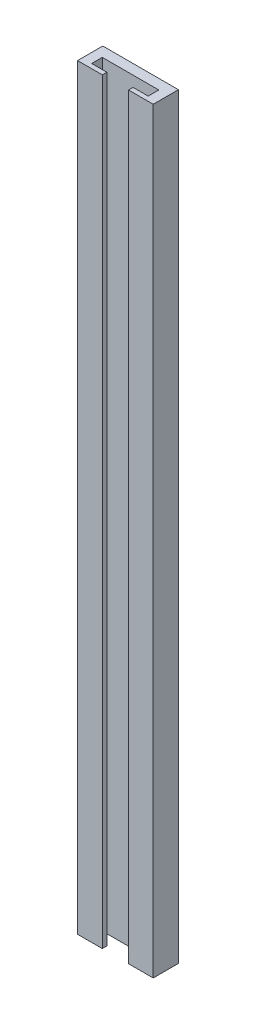
ISO-10303-21;
HEADER;
FILE_DESCRIPTION(('STEP AP214'),'2;1');
FILE_NAME('part.step','',(''),(''),'','','');
FILE_SCHEMA(('AUTOMOTIVE_DESIGN { 1 0 10303 214 1 1 1 1 }'));
ENDSEC;
DATA;
#1=APPLICATION_CONTEXT('core data for automotive mechanical design processes');
#2=APPLICATION_PROTOCOL_DEFINITION('international standard','automotive_design',2000,#1);
#3=PRODUCT_CONTEXT('',#1,'mechanical');
#4=PRODUCT('Part','Part','',(#3));
#5=PRODUCT_RELATED_PRODUCT_CATEGORY('part','',(#4));
#6=PRODUCT_DEFINITION_FORMATION('','',#4);
#7=PRODUCT_DEFINITION_CONTEXT('part definition',#1,'design');
#8=PRODUCT_DEFINITION('design','',#6,#7);
#9=PRODUCT_DEFINITION_SHAPE('','',#8);
#10=(LENGTH_UNIT() NAMED_UNIT(*) SI_UNIT(.MILLI.,.METRE.));
#11=(NAMED_UNIT(*) PLANE_ANGLE_UNIT() SI_UNIT($,.RADIAN.));
#12=(NAMED_UNIT(*) SI_UNIT($,.STERADIAN.) SOLID_ANGLE_UNIT());
#13=UNCERTAINTY_MEASURE_WITH_UNIT(LENGTH_MEASURE(1.E-05),#10,'distance_accuracy_value','');
#14=(GEOMETRIC_REPRESENTATION_CONTEXT(3) GLOBAL_UNCERTAINTY_ASSIGNED_CONTEXT((#13)) GLOBAL_UNIT_ASSIGNED_CONTEXT((#10,
#11,#12)) REPRESENTATION_CONTEXT('',''));
#15=CARTESIAN_POINT('',(0.,0.,0.));
#16=DIRECTION('',(0.,0.,1.));
#17=DIRECTION('',(1.,0.,0.));
#18=AXIS2_PLACEMENT_3D('',#15,#16,#17);
#19=CARTESIAN_POINT('',(4.3745606689616,150.,6.92142297910839));
#20=DIRECTION('',(-1.,0.,0.));
#21=DIRECTION('',(0.,0.,1.));
#22=AXIS2_PLACEMENT_3D('',#19,#20,#21);
#23=PLANE('',#22);
#24=DIRECTION('',(0.,0.,-1.));
#25=VECTOR('',#24,1.);
#26=CARTESIAN_POINT('',(4.3745606689616,0.,6.92142297910839));
#27=LINE('',#26,#25);
#28=CARTESIAN_POINT('',(4.3745606689616,0.,6.92142297910839));
#29=VERTEX_POINT('',#28);
#30=CARTESIAN_POINT('',(4.3745606689616,0.,1.92142297910839));
#31=VERTEX_POINT('',#30);
#32=EDGE_CURVE('E144',#29,#31,#27,.T.);
#33=ORIENTED_EDGE('',*,*,#32,.F.);
#34=DIRECTION('',(0.,-1.,0.));
#35=VECTOR('',#34,1.);
#36=CARTESIAN_POINT('',(4.3745606689616,150.,6.92142297910839));
#37=LINE('',#36,#35);
#38=CARTESIAN_POINT('',(4.3745606689616,150.,6.92142297910839));
#39=VERTEX_POINT('',#38);
#40=EDGE_CURVE('E31',#39,#29,#37,.T.);
#41=ORIENTED_EDGE('',*,*,#40,.F.);
#42=DIRECTION('',(0.,0.,-1.));
#43=VECTOR('',#42,1.);
#44=CARTESIAN_POINT('',(4.3745606689616,150.,6.92142297910839));
#45=LINE('',#44,#43);
#46=CARTESIAN_POINT('',(4.3745606689616,150.,1.92142297910839));
#47=VERTEX_POINT('',#46);
#48=EDGE_CURVE('E135',#39,#47,#45,.T.);
#49=ORIENTED_EDGE('',*,*,#48,.T.);
#50=DIRECTION('',(0.,-1.,0.));
#51=VECTOR('',#50,1.);
#52=CARTESIAN_POINT('',(4.3745606689616,150.,1.92142297910839));
#53=LINE('',#52,#51);
#54=EDGE_CURVE('E9',#47,#31,#53,.T.);
#55=ORIENTED_EDGE('',*,*,#54,.T.);
#56=EDGE_LOOP('',(#33,#41,#49,#55));
#57=FACE_BOUND('',#56,.T.);
#58=ADVANCED_FACE('F15',(#57),#23,.T.);
#59=CARTESIAN_POINT('',(4.3745606689616,150.,1.92142297910839));
#60=DIRECTION('',(0.,0.,-1.));
#61=DIRECTION('',(-1.,0.,0.));
#62=AXIS2_PLACEMENT_3D('',#59,#60,#61);
#63=PLANE('',#62);
#64=DIRECTION('',(1.,0.,0.));
#65=VECTOR('',#64,1.);
#66=CARTESIAN_POINT('',(4.3745606689616,0.,1.92142297910839));
#67=LINE('',#66,#65);
#68=CARTESIAN_POINT('',(19.3745606689616,0.,1.92142297910839));
#69=VERTEX_POINT('',#68);
#70=EDGE_CURVE('E139',#31,#69,#67,.T.);
#71=ORIENTED_EDGE('',*,*,#70,.F.);
#72=ORIENTED_EDGE('',*,*,#54,.F.);
#73=DIRECTION('',(1.,0.,0.));
#74=VECTOR('',#73,1.);
#75=CARTESIAN_POINT('',(4.3745606689616,150.,1.92142297910839));
#76=LINE('',#75,#74);
#77=CARTESIAN_POINT('',(19.3745606689616,150.,1.92142297910839));
#78=VERTEX_POINT('',#77);
#79=EDGE_CURVE('E137',#47,#78,#76,.T.);
#80=ORIENTED_EDGE('',*,*,#79,.T.);
#81=DIRECTION('',(0.,-1.,0.));
#82=VECTOR('',#81,1.);
#83=CARTESIAN_POINT('',(19.3745606689616,150.,1.92142297910839));
#84=LINE('',#83,#82);
#85=EDGE_CURVE('E23',#78,#69,#84,.T.);
#86=ORIENTED_EDGE('',*,*,#85,.T.);
#87=EDGE_LOOP('',(#71,#72,#80,#86));
#88=FACE_BOUND('',#87,.T.);
#89=ADVANCED_FACE('F197',(#88),#63,.T.);
#90=CARTESIAN_POINT('',(19.3745606689616,150.,1.92142297910839));
#91=DIRECTION('',(1.,0.,0.));
#92=DIRECTION('',(0.,0.,-1.));
#93=AXIS2_PLACEMENT_3D('',#90,#91,#92);
#94=PLANE('',#93);
#95=DIRECTION('',(0.,0.,1.));
#96=VECTOR('',#95,1.);
#97=CARTESIAN_POINT('',(19.3745606689616,0.,1.92142297910839));
#98=LINE('',#97,#96);
#99=CARTESIAN_POINT('',(19.3745606689616,0.,6.92142297910839));
#100=VERTEX_POINT('',#99);
#101=EDGE_CURVE('E143',#69,#100,#98,.T.);
#102=ORIENTED_EDGE('',*,*,#101,.F.);
#103=ORIENTED_EDGE('',*,*,#85,.F.);
#104=DIRECTION('',(0.,0.,1.));
#105=VECTOR('',#104,1.);
#106=CARTESIAN_POINT('',(19.3745606689616,150.,1.92142297910839));
#107=LINE('',#106,#105);
#108=CARTESIAN_POINT('',(19.3745606689616,150.,6.92142297910839));
#109=VERTEX_POINT('',#108);
#110=EDGE_CURVE('E206',#78,#109,#107,.T.);
#111=ORIENTED_EDGE('',*,*,#110,.T.);
#112=DIRECTION('',(0.,-1.,0.));
#113=VECTOR('',#112,1.);
#114=CARTESIAN_POINT('',(19.3745606689616,150.,6.92142297910839));
#115=LINE('',#114,#113);
#116=EDGE_CURVE('E195',#109,#100,#115,.T.);
#117=ORIENTED_EDGE('',*,*,#116,.T.);
#118=EDGE_LOOP('',(#102,#103,#111,#117));
#119=FACE_BOUND('',#118,.T.);
#120=ADVANCED_FACE('F201',(#119),#94,.T.);
#121=CARTESIAN_POINT('',(19.3745606689616,150.,6.92142297910839));
#122=DIRECTION('',(0.,0.,1.));
#123=DIRECTION('',(1.,0.,0.));
#124=AXIS2_PLACEMENT_3D('',#121,#122,#123);
#125=PLANE('',#124);
#126=DIRECTION('',(-1.,0.,0.));
#127=VECTOR('',#126,1.);
#128=CARTESIAN_POINT('',(19.3745606689616,0.,6.92142297910839));
#129=LINE('',#128,#127);
#130=CARTESIAN_POINT('',(14.4745606689616,0.,6.92142297910839));
#131=VERTEX_POINT('',#130);
#132=EDGE_CURVE('E148',#100,#131,#129,.T.);
#133=ORIENTED_EDGE('',*,*,#132,.F.);
#134=ORIENTED_EDGE('',*,*,#116,.F.);
#135=DIRECTION('',(-1.,0.,0.));
#136=VECTOR('',#135,1.);
#137=CARTESIAN_POINT('',(19.3745606689616,150.,6.92142297910839));
#138=LINE('',#137,#136);
#139=CARTESIAN_POINT('',(14.4745606689616,150.,6.92142297910839));
#140=VERTEX_POINT('',#139);
#141=EDGE_CURVE('E208',#109,#140,#138,.T.);
#142=ORIENTED_EDGE('',*,*,#141,.T.);
#143=DIRECTION('',(0.,-1.,0.));
#144=VECTOR('',#143,1.);
#145=CARTESIAN_POINT('',(14.4745606689616,150.,6.92142297910839));
#146=LINE('',#145,#144);
#147=EDGE_CURVE('E193',#140,#131,#146,.T.);
#148=ORIENTED_EDGE('',*,*,#147,.T.);
#149=EDGE_LOOP('',(#133,#134,#142,#148));
#150=FACE_BOUND('',#149,.T.);
#151=ADVANCED_FACE('F244',(#150),#125,.T.);
#152=CARTESIAN_POINT('',(14.4745606689616,150.,6.92142297910839));
#153=DIRECTION('',(-1.,0.,0.));
#154=DIRECTION('',(0.,0.,1.));
#155=AXIS2_PLACEMENT_3D('',#152,#153,#154);
#156=PLANE('',#155);
#157=DIRECTION('',(0.,0.,-1.));
#158=VECTOR('',#157,1.);
#159=CARTESIAN_POINT('',(14.4745606689616,0.,6.92142297910839));
#160=LINE('',#159,#158);
#161=CARTESIAN_POINT('',(14.4745606689616,0.,6.02142297910839));
#162=VERTEX_POINT('',#161);
#163=EDGE_CURVE('E152',#131,#162,#160,.T.);
#164=ORIENTED_EDGE('',*,*,#163,.F.);
#165=ORIENTED_EDGE('',*,*,#147,.F.);
#166=DIRECTION('',(0.,0.,-1.));
#167=VECTOR('',#166,1.);
#168=CARTESIAN_POINT('',(14.4745606689616,150.,6.92142297910839));
#169=LINE('',#168,#167);
#170=CARTESIAN_POINT('',(14.4745606689616,150.,6.02142297910839));
#171=VERTEX_POINT('',#170);
#172=EDGE_CURVE('E213',#140,#171,#169,.T.);
#173=ORIENTED_EDGE('',*,*,#172,.T.);
#174=DIRECTION('',(0.,-1.,0.));
#175=VECTOR('',#174,1.);
#176=CARTESIAN_POINT('',(14.4745606689616,150.,6.02142297910839));
#177=LINE('',#176,#175);
#178=EDGE_CURVE('E191',#171,#162,#177,.T.);
#179=ORIENTED_EDGE('',*,*,#178,.T.);
#180=EDGE_LOOP('',(#164,#165,#173,#179));
#181=FACE_BOUND('',#180,.T.);
#182=ADVANCED_FACE('F242',(#181),#156,.T.);
#183=CARTESIAN_POINT('',(14.4745606689616,150.,6.02142297910839));
#184=DIRECTION('',(0.,0.,-1.));
#185=DIRECTION('',(-1.,0.,0.));
#186=AXIS2_PLACEMENT_3D('',#183,#184,#185);
#187=PLANE('',#186);
#188=DIRECTION('',(1.,0.,0.));
#189=VECTOR('',#188,1.);
#190=CARTESIAN_POINT('',(14.4745606689616,0.,6.02142297910839));
#191=LINE('',#190,#189);
#192=CARTESIAN_POINT('',(17.4745606689616,0.,6.02142297910839));
#193=VERTEX_POINT('',#192);
#194=EDGE_CURVE('E156',#162,#193,#191,.T.);
#195=ORIENTED_EDGE('',*,*,#194,.F.);
#196=ORIENTED_EDGE('',*,*,#178,.F.);
#197=DIRECTION('',(1.,0.,0.));
#198=VECTOR('',#197,1.);
#199=CARTESIAN_POINT('',(14.4745606689616,150.,6.02142297910839));
#200=LINE('',#199,#198);
#201=CARTESIAN_POINT('',(17.4745606689616,150.,6.02142297910839));
#202=VERTEX_POINT('',#201);
#203=EDGE_CURVE('E216',#171,#202,#200,.T.);
#204=ORIENTED_EDGE('',*,*,#203,.T.);
#205=DIRECTION('',(0.,-1.,0.));
#206=VECTOR('',#205,1.);
#207=CARTESIAN_POINT('',(17.4745606689616,150.,6.02142297910839));
#208=LINE('',#207,#206);
#209=EDGE_CURVE('E189',#202,#193,#208,.T.);
#210=ORIENTED_EDGE('',*,*,#209,.T.);
#211=EDGE_LOOP('',(#195,#196,#204,#210));
#212=FACE_BOUND('',#211,.T.);
#213=ADVANCED_FACE('F238',(#212),#187,.T.);
#214=CARTESIAN_POINT('',(17.4745606689616,150.,6.02142297910839));
#215=DIRECTION('',(-1.,0.,0.));
#216=DIRECTION('',(0.,0.,1.));
#217=AXIS2_PLACEMENT_3D('',#214,#215,#216);
#218=PLANE('',#217);
#219=DIRECTION('',(0.,0.,-1.));
#220=VECTOR('',#219,1.);
#221=CARTESIAN_POINT('',(17.4745606689616,0.,6.02142297910839));
#222=LINE('',#221,#220);
#223=CARTESIAN_POINT('',(17.4745606689616,0.,3.92142297910839));
#224=VERTEX_POINT('',#223);
#225=EDGE_CURVE('E160',#193,#224,#222,.T.);
#226=ORIENTED_EDGE('',*,*,#225,.F.);
#227=ORIENTED_EDGE('',*,*,#209,.F.);
#228=DIRECTION('',(0.,0.,-1.));
#229=VECTOR('',#228,1.);
#230=CARTESIAN_POINT('',(17.4745606689616,150.,6.02142297910839));
#231=LINE('',#230,#229);
#232=CARTESIAN_POINT('',(17.4745606689616,150.,3.92142297910839));
#233=VERTEX_POINT('',#232);
#234=EDGE_CURVE('E219',#202,#233,#231,.T.);
#235=ORIENTED_EDGE('',*,*,#234,.T.);
#236=DIRECTION('',(0.,-1.,0.));
#237=VECTOR('',#236,1.);
#238=CARTESIAN_POINT('',(17.4745606689616,150.,3.92142297910839));
#239=LINE('',#238,#237);
#240=EDGE_CURVE('E187',#233,#224,#239,.T.);
#241=ORIENTED_EDGE('',*,*,#240,.T.);
#242=EDGE_LOOP('',(#226,#227,#235,#241));
#243=FACE_BOUND('',#242,.T.);
#244=ADVANCED_FACE('F235',(#243),#218,.T.);
#245=CARTESIAN_POINT('',(17.4745606689616,150.,3.92142297910839));
#246=DIRECTION('',(0.,0.,1.));
#247=DIRECTION('',(1.,0.,0.));
#248=AXIS2_PLACEMENT_3D('',#245,#246,#247);
#249=PLANE('',#248);
#250=DIRECTION('',(-1.,0.,0.));
#251=VECTOR('',#250,1.);
#252=CARTESIAN_POINT('',(17.4745606689616,0.,3.92142297910839));
#253=LINE('',#252,#251);
#254=CARTESIAN_POINT('',(6.2745606689616,0.,3.92142297910839));
#255=VERTEX_POINT('',#254);
#256=EDGE_CURVE('E164',#224,#255,#253,.T.);
#257=ORIENTED_EDGE('',*,*,#256,.F.);
#258=ORIENTED_EDGE('',*,*,#240,.F.);
#259=DIRECTION('',(-1.,0.,0.));
#260=VECTOR('',#259,1.);
#261=CARTESIAN_POINT('',(17.4745606689616,150.,3.92142297910839));
#262=LINE('',#261,#260);
#263=CARTESIAN_POINT('',(6.2745606689616,150.,3.92142297910839));
#264=VERTEX_POINT('',#263);
#265=EDGE_CURVE('E222',#233,#264,#262,.T.);
#266=ORIENTED_EDGE('',*,*,#265,.T.);
#267=DIRECTION('',(0.,-1.,0.));
#268=VECTOR('',#267,1.);
#269=CARTESIAN_POINT('',(6.2745606689616,150.,3.92142297910839));
#270=LINE('',#269,#268);
#271=EDGE_CURVE('E185',#264,#255,#270,.T.);
#272=ORIENTED_EDGE('',*,*,#271,.T.);
#273=EDGE_LOOP('',(#257,#258,#266,#272));
#274=FACE_BOUND('',#273,.T.);
#275=ADVANCED_FACE('F232',(#274),#249,.T.);
#276=CARTESIAN_POINT('',(6.2745606689616,150.,3.92142297910839));
#277=DIRECTION('',(1.,0.,0.));
#278=DIRECTION('',(0.,0.,-1.));
#279=AXIS2_PLACEMENT_3D('',#276,#277,#278);
#280=PLANE('',#279);
#281=DIRECTION('',(0.,0.,1.));
#282=VECTOR('',#281,1.);
#283=CARTESIAN_POINT('',(6.2745606689616,0.,3.92142297910839));
#284=LINE('',#283,#282);
#285=CARTESIAN_POINT('',(6.2745606689616,0.,6.02142297910839));
#286=VERTEX_POINT('',#285);
#287=EDGE_CURVE('E168',#255,#286,#284,.T.);
#288=ORIENTED_EDGE('',*,*,#287,.F.);
#289=ORIENTED_EDGE('',*,*,#271,.F.);
#290=DIRECTION('',(0.,0.,1.));
#291=VECTOR('',#290,1.);
#292=CARTESIAN_POINT('',(6.2745606689616,150.,3.92142297910839));
#293=LINE('',#292,#291);
#294=CARTESIAN_POINT('',(6.2745606689616,150.,6.02142297910839));
#295=VERTEX_POINT('',#294);
#296=EDGE_CURVE('E126',#264,#295,#293,.T.);
#297=ORIENTED_EDGE('',*,*,#296,.T.);
#298=DIRECTION('',(0.,-1.,0.));
#299=VECTOR('',#298,1.);
#300=CARTESIAN_POINT('',(6.2745606689616,150.,6.02142297910839));
#301=LINE('',#300,#299);
#302=EDGE_CURVE('E118',#295,#286,#301,.T.);
#303=ORIENTED_EDGE('',*,*,#302,.T.);
#304=EDGE_LOOP('',(#288,#289,#297,#303));
#305=FACE_BOUND('',#304,.T.);
#306=ADVANCED_FACE('F226',(#305),#280,.T.);
#307=CARTESIAN_POINT('',(6.2745606689616,150.,6.02142297910839));
#308=DIRECTION('',(0.,0.,-1.));
#309=DIRECTION('',(-1.,0.,0.));
#310=AXIS2_PLACEMENT_3D('',#307,#308,#309);
#311=PLANE('',#310);
#312=DIRECTION('',(1.,0.,0.));
#313=VECTOR('',#312,1.);
#314=CARTESIAN_POINT('',(6.2745606689616,0.,6.02142297910839));
#315=LINE('',#314,#313);
#316=CARTESIAN_POINT('',(9.2745606689616,0.,6.02142297910839));
#317=VERTEX_POINT('',#316);
#318=EDGE_CURVE('E172',#286,#317,#315,.T.);
#319=ORIENTED_EDGE('',*,*,#318,.F.);
#320=ORIENTED_EDGE('',*,*,#302,.F.);
#321=DIRECTION('',(1.,0.,0.));
#322=VECTOR('',#321,1.);
#323=CARTESIAN_POINT('',(6.2745606689616,150.,6.02142297910839));
#324=LINE('',#323,#322);
#325=CARTESIAN_POINT('',(9.2745606689616,150.,6.02142297910839));
#326=VERTEX_POINT('',#325);
#327=EDGE_CURVE('E121',#295,#326,#324,.T.);
#328=ORIENTED_EDGE('',*,*,#327,.T.);
#329=DIRECTION('',(0.,-1.,0.));
#330=VECTOR('',#329,1.);
#331=CARTESIAN_POINT('',(9.2745606689616,150.,6.02142297910839));
#332=LINE('',#331,#330);
#333=EDGE_CURVE('E107',#326,#317,#332,.T.);
#334=ORIENTED_EDGE('',*,*,#333,.T.);
#335=EDGE_LOOP('',(#319,#320,#328,#334));
#336=FACE_BOUND('',#335,.T.);
#337=ADVANCED_FACE('F122',(#336),#311,.T.);
#338=CARTESIAN_POINT('',(9.2745606689616,150.,6.02142297910839));
#339=DIRECTION('',(1.,0.,0.));
#340=DIRECTION('',(0.,0.,-1.));
#341=AXIS2_PLACEMENT_3D('',#338,#339,#340);
#342=PLANE('',#341);
#343=DIRECTION('',(0.,0.,1.));
#344=VECTOR('',#343,1.);
#345=CARTESIAN_POINT('',(9.2745606689616,0.,6.02142297910839));
#346=LINE('',#345,#344);
#347=CARTESIAN_POINT('',(9.2745606689616,0.,6.92142297910839));
#348=VERTEX_POINT('',#347);
#349=EDGE_CURVE('E114',#317,#348,#346,.T.);
#350=ORIENTED_EDGE('',*,*,#349,.F.);
#351=ORIENTED_EDGE('',*,*,#333,.F.);
#352=DIRECTION('',(0.,0.,1.));
#353=VECTOR('',#352,1.);
#354=CARTESIAN_POINT('',(9.2745606689616,150.,6.02142297910839));
#355=LINE('',#354,#353);
#356=CARTESIAN_POINT('',(9.2745606689616,150.,6.92142297910839));
#357=VERTEX_POINT('',#356);
#358=EDGE_CURVE('E111',#326,#357,#355,.T.);
#359=ORIENTED_EDGE('',*,*,#358,.T.);
#360=DIRECTION('',(0.,-1.,0.));
#361=VECTOR('',#360,1.);
#362=CARTESIAN_POINT('',(9.2745606689616,150.,6.92142297910839));
#363=LINE('',#362,#361);
#364=EDGE_CURVE('E71',#357,#348,#363,.T.);
#365=ORIENTED_EDGE('',*,*,#364,.T.);
#366=EDGE_LOOP('',(#350,#351,#359,#365));
#367=FACE_BOUND('',#366,.T.);
#368=ADVANCED_FACE('F109',(#367),#342,.T.);
#369=CARTESIAN_POINT('',(9.2745606689616,150.,6.92142297910839));
#370=DIRECTION('',(0.,0.,1.));
#371=DIRECTION('',(1.,0.,0.));
#372=AXIS2_PLACEMENT_3D('',#369,#370,#371);
#373=PLANE('',#372);
#374=DIRECTION('',(-1.,0.,0.));
#375=VECTOR('',#374,1.);
#376=CARTESIAN_POINT('',(9.2745606689616,0.,6.92142297910839));
#377=LINE('',#376,#375);
#378=EDGE_CURVE('E138',#348,#29,#377,.T.);
#379=ORIENTED_EDGE('',*,*,#378,.F.);
#380=ORIENTED_EDGE('',*,*,#364,.F.);
#381=DIRECTION('',(-1.,0.,0.));
#382=VECTOR('',#381,1.);
#383=CARTESIAN_POINT('',(9.2745606689616,150.,6.92142297910839));
#384=LINE('',#383,#382);
#385=EDGE_CURVE('E130',#357,#39,#384,.T.);
#386=ORIENTED_EDGE('',*,*,#385,.T.);
#387=ORIENTED_EDGE('',*,*,#40,.T.);
#388=EDGE_LOOP('',(#379,#380,#386,#387));
#389=FACE_BOUND('',#388,.T.);
#390=ADVANCED_FACE('F336',(#389),#373,.T.);
#391=CARTESIAN_POINT('',(0.,150.,0.));
#392=DIRECTION('',(0.,-1.,0.));
#393=DIRECTION('',(0.,0.,-1.));
#394=AXIS2_PLACEMENT_3D('',#391,#392,#393);
#395=PLANE('',#394);
#396=ORIENTED_EDGE('',*,*,#48,.F.);
#397=ORIENTED_EDGE('',*,*,#385,.F.);
#398=ORIENTED_EDGE('',*,*,#358,.F.);
#399=ORIENTED_EDGE('',*,*,#327,.F.);
#400=ORIENTED_EDGE('',*,*,#296,.F.);
#401=ORIENTED_EDGE('',*,*,#265,.F.);
#402=ORIENTED_EDGE('',*,*,#234,.F.);
#403=ORIENTED_EDGE('',*,*,#203,.F.);
#404=ORIENTED_EDGE('',*,*,#172,.F.);
#405=ORIENTED_EDGE('',*,*,#141,.F.);
#406=ORIENTED_EDGE('',*,*,#110,.F.);
#407=ORIENTED_EDGE('',*,*,#79,.F.);
#408=EDGE_LOOP('',(#396,#397,#398,#399,#400,#401,#402,#403,#404,#405,#406,#407));
#409=FACE_BOUND('',#408,.T.);
#410=ADVANCED_FACE('F129',(#409),#395,.F.);
#411=CARTESIAN_POINT('',(0.,0.,0.));
#412=DIRECTION('',(0.,-1.,0.));
#413=DIRECTION('',(0.,0.,-1.));
#414=AXIS2_PLACEMENT_3D('',#411,#412,#413);
#415=PLANE('',#414);
#416=ORIENTED_EDGE('',*,*,#32,.T.);
#417=ORIENTED_EDGE('',*,*,#70,.T.);
#418=ORIENTED_EDGE('',*,*,#101,.T.);
#419=ORIENTED_EDGE('',*,*,#132,.T.);
#420=ORIENTED_EDGE('',*,*,#163,.T.);
#421=ORIENTED_EDGE('',*,*,#194,.T.);
#422=ORIENTED_EDGE('',*,*,#225,.T.);
#423=ORIENTED_EDGE('',*,*,#256,.T.);
#424=ORIENTED_EDGE('',*,*,#287,.T.);
#425=ORIENTED_EDGE('',*,*,#318,.T.);
#426=ORIENTED_EDGE('',*,*,#349,.T.);
#427=ORIENTED_EDGE('',*,*,#378,.T.);
#428=EDGE_LOOP('',(#416,#417,#418,#419,#420,#421,#422,#423,#424,#425,#426,#427));
#429=FACE_BOUND('',#428,.T.);
#430=ADVANCED_FACE('F204',(#429),#415,.T.);
#431=CLOSED_SHELL('',(#58,#89,#120,#151,#182,#213,#244,#275,#306,#337,#368,#390,#410,#430));
#432=MANIFOLD_SOLID_BREP('B1',#431);
#433=ADVANCED_BREP_SHAPE_REPRESENTATION('',(#18,#432),#14);
#434=SHAPE_DEFINITION_REPRESENTATION(#9,#433);
ENDSEC;
END-ISO-10303-21;
